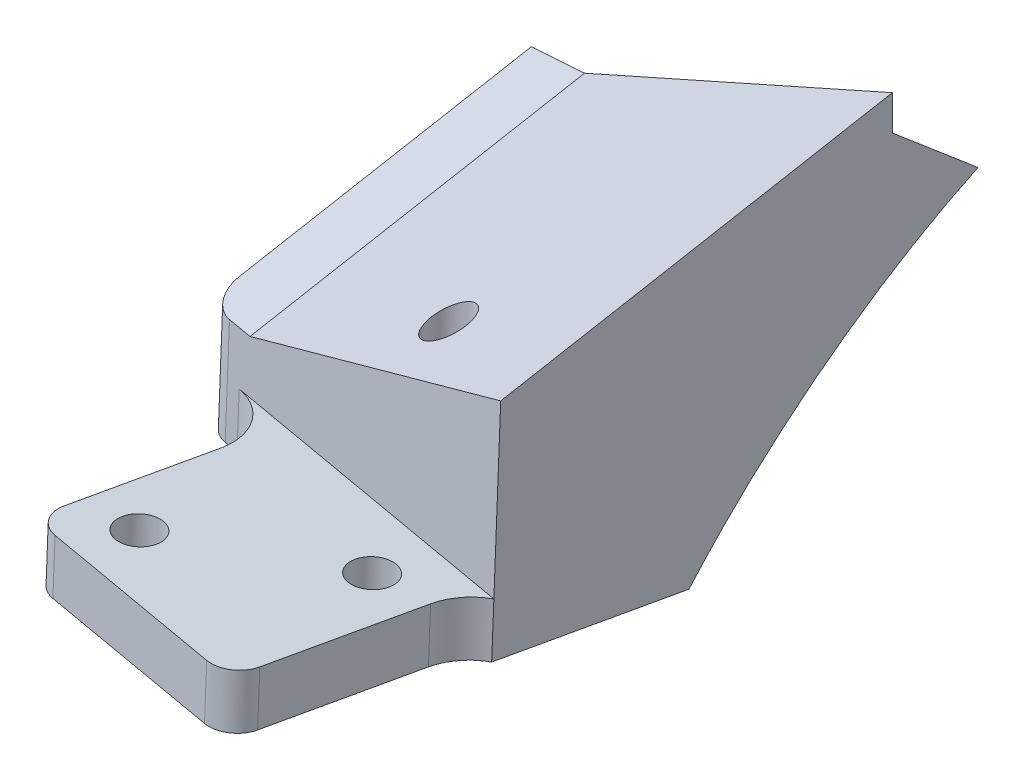
ISO-10303-21;
HEADER;
FILE_DESCRIPTION(('STEP AP214'),'2;1');
FILE_NAME('part.step','',(''),(''),'','','');
FILE_SCHEMA(('AUTOMOTIVE_DESIGN { 1 0 10303 214 1 1 1 1 }'));
ENDSEC;
DATA;
#1=APPLICATION_CONTEXT('core data for automotive mechanical design processes');
#2=APPLICATION_PROTOCOL_DEFINITION('international standard','automotive_design',2000,#1);
#3=PRODUCT_CONTEXT('',#1,'mechanical');
#4=PRODUCT('Part','Part','',(#3));
#5=PRODUCT_RELATED_PRODUCT_CATEGORY('part','',(#4));
#6=PRODUCT_DEFINITION_FORMATION('','',#4);
#7=PRODUCT_DEFINITION_CONTEXT('part definition',#1,'design');
#8=PRODUCT_DEFINITION('design','',#6,#7);
#9=PRODUCT_DEFINITION_SHAPE('','',#8);
#10=(LENGTH_UNIT() NAMED_UNIT(*) SI_UNIT(.MILLI.,.METRE.));
#11=(NAMED_UNIT(*) PLANE_ANGLE_UNIT() SI_UNIT($,.RADIAN.));
#12=(NAMED_UNIT(*) SI_UNIT($,.STERADIAN.) SOLID_ANGLE_UNIT());
#13=UNCERTAINTY_MEASURE_WITH_UNIT(LENGTH_MEASURE(1.E-05),#10,'distance_accuracy_value','');
#14=(GEOMETRIC_REPRESENTATION_CONTEXT(3) GLOBAL_UNCERTAINTY_ASSIGNED_CONTEXT((#13)) GLOBAL_UNIT_ASSIGNED_CONTEXT((#10,
#11,#12)) REPRESENTATION_CONTEXT('',''));
#15=CARTESIAN_POINT('',(0.,0.,0.));
#16=DIRECTION('',(0.,0.,1.));
#17=DIRECTION('',(1.,0.,0.));
#18=AXIS2_PLACEMENT_3D('',#15,#16,#17);
#19=CARTESIAN_POINT('',(824.732085834627,5821.44498100306,18.9934864671472));
#20=DIRECTION('',(-0.00606023370630814,-0.999390827085141,0.0343692930608406));
#21=DIRECTION('',(0.,0.0343699242089877,0.999409179620574));
#22=AXIS2_PLACEMENT_3D('',#19,#20,#21);
#23=PLANE('',#22);
#24=CARTESIAN_POINT('',(838.819100795339,5821.1208398731,12.0520265814064));
#25=DIRECTION('',(-0.00606023370630814,-0.999390827085141,0.0343692930608406));
#26=DIRECTION('',(-0.462317085890736,-0.0276760183058803,-0.88628265813127));
#27=AXIS2_PLACEMENT_3D('',#24,#25,#26);
#28=ELLIPSE('',#27,3.48633872282764,2.52729999999997);
#29=CARTESIAN_POINT('',(837.207306836573,5821.02435189878,8.9621450309927));
#30=VERTEX_POINT('',#29);
#31=EDGE_CURVE('E329',#30,#30,#28,.T.);
#32=ORIENTED_EDGE('',*,*,#31,.F.);
#33=EDGE_LOOP('',(#32));
#34=FACE_BOUND('',#33,.T.);
#35=DIRECTION('',(-0.394397487112533,0.0339725620847751,0.918311759254293));
#36=VECTOR('',#35,1.);
#37=CARTESIAN_POINT('',(821.226521874585,5820.95180967383,4.0349175322677));
#38=LINE('',#37,#36);
#39=CARTESIAN_POINT('',(823.135376170953,5820.78738501795,-0.409642598910876));
#40=VERTEX_POINT('',#39);
#41=CARTESIAN_POINT('',(821.371793384874,5820.9392962944,3.69666858154716));
#42=VERTEX_POINT('',#41);
#43=EDGE_CURVE('E219',#40,#42,#38,.T.);
#44=ORIENTED_EDGE('',*,*,#43,.F.);
#45=DIRECTION('',(0.984807753010193,-3.09363076460256E-11,0.17364817767836));
#46=VECTOR('',#45,1.);
#47=CARTESIAN_POINT('',(859.669425506688,5820.78738501681,6.03229601399774));
#48=LINE('',#47,#46);
#49=CARTESIAN_POINT('',(838.636761234494,5820.78738501747,2.32366982637515));
#50=VERTEX_POINT('',#49);
#51=EDGE_CURVE('E292',#40,#50,#48,.T.);
#52=ORIENTED_EDGE('',*,*,#51,.T.);
#53=CARTESIAN_POINT('',(838.836445724791,5820.85675702432,4.37607986175295));
#54=DIRECTION('',(-0.00606023370630814,-0.999390827085141,0.0343692930608406));
#55=DIRECTION('',(-0.462317085890736,-0.0276760183058803,-0.88628265813127));
#56=AXIS2_PLACEMENT_3D('',#53,#54,#55);
#57=ELLIPSE('',#56,2.18991125805627,1.58749999999905);
#58=CARTESIAN_POINT('',(840.32308241607,5820.82814107145,3.80611890873291));
#59=VERTEX_POINT('',#58);
#60=EDGE_CURVE('E67',#50,#59,#57,.T.);
#61=ORIENTED_EDGE('',*,*,#60,.T.);
#62=CARTESIAN_POINT('',(862.622632785247,5820.3989017783,-4.74329538659908));
#63=DIRECTION('',(-0.00606023370630814,-0.999390827085141,0.0343692930608406));
#64=DIRECTION('',(-0.462317085890736,-0.0276760183058803,-0.88628265813127));
#65=AXIS2_PLACEMENT_3D('',#62,#63,#64);
#66=ELLIPSE('',#65,32.8486688708639,23.8125);
#67=CARTESIAN_POINT('',(860.135504626068,5821.41636155642,24.4038677292095));
#68=VERTEX_POINT('',#67);
#69=EDGE_CURVE('E55',#59,#68,#66,.F.);
#70=ORIENTED_EDGE('',*,*,#69,.T.);
#71=DIRECTION('',(0.173542395900398,-0.0348994948111996,-0.984207834802727));
#72=VECTOR('',#71,1.);
#73=CARTESIAN_POINT('',(856.654669511219,5822.11635988478,44.1446646331368));
#74=LINE('',#73,#72);
#75=CARTESIAN_POINT('',(856.654669511219,5822.11635988478,44.1446646331368));
#76=VERTEX_POINT('',#75);
#77=EDGE_CURVE('E263',#76,#68,#74,.T.);
#78=ORIENTED_EDGE('',*,*,#77,.F.);
#79=CARTESIAN_POINT('',(859.845174788359,5822.28573508757,49.6323315327014));
#80=DIRECTION('',(0.00606023370630814,0.999390827085141,-0.0343692930608406));
#81=DIRECTION('',(0.,0.0343699242089877,0.999409179620574));
#82=AXIS2_PLACEMENT_3D('',#79,#80,#81);
#83=CIRCLE('',#82,6.35);
#84=CARTESIAN_POINT('',(853.591645556733,5822.28573508801,48.5296656045025));
#85=VERTEX_POINT('',#84);
#86=EDGE_CURVE('E235',#85,#76,#83,.F.);
#87=ORIENTED_EDGE('',*,*,#86,.F.);
#88=DIRECTION('',(0.173542395900156,-0.0348994948112074,-0.98420783480277));
#89=VECTOR('',#88,1.);
#90=CARTESIAN_POINT('',(850.025909509087,5823.00280705217,68.7519596250967));
#91=LINE('',#90,#89);
#92=CARTESIAN_POINT('',(850.576906616351,5822.89200115609,65.6270997480084));
#93=VERTEX_POINT('',#92);
#94=EDGE_CURVE('E252',#93,#85,#91,.T.);
#95=ORIENTED_EDGE('',*,*,#94,.F.);
#96=CARTESIAN_POINT('',(847.450142000536,5822.89200115595,65.0757667839216));
#97=DIRECTION('',(0.00606023370630814,0.999390827085141,-0.0343692930608406));
#98=DIRECTION('',(0.,0.0343699242089877,0.999409179620574));
#99=AXIS2_PLACEMENT_3D('',#96,#97,#98);
#100=CIRCLE('',#99,3.175);
#101=CARTESIAN_POINT('',(846.899144891964,5823.00280705219,68.2006266591323));
#102=VERTEX_POINT('',#101);
#103=EDGE_CURVE('E226',#102,#93,#100,.T.);
#104=ORIENTED_EDGE('',*,*,#103,.F.);
#105=DIRECTION('',(0.984807752923825,-6.26330527505035E-12,0.173648178168175));
#106=VECTOR('',#105,1.);
#107=CARTESIAN_POINT('',(822.095449303528,5823.00280705235,63.8270658925945));
#108=LINE('',#107,#106);
#109=CARTESIAN_POINT('',(825.222213917472,5823.00280705233,64.3783988579982));
#110=VERTEX_POINT('',#109);
#111=EDGE_CURVE('E258',#110,#102,#108,.T.);
#112=ORIENTED_EDGE('',*,*,#111,.F.);
#113=CARTESIAN_POINT('',(825.773211026045,5822.89200115624,61.2535389827819));
#114=DIRECTION('',(0.00606023370630814,0.999390827085141,-0.0343692930608406));
#115=DIRECTION('',(0.,0.0343699242089877,0.999409179620574));
#116=AXIS2_PLACEMENT_3D('',#113,#114,#115);
#117=CIRCLE('',#116,3.175);
#118=CARTESIAN_POINT('',(822.646446410232,5822.89200115638,60.7022060186847));
#119=VERTEX_POINT('',#118);
#120=EDGE_CURVE('E349',#119,#110,#117,.T.);
#121=ORIENTED_EDGE('',*,*,#120,.F.);
#122=DIRECTION('',(-0.173542395900381,0.034899494811193,0.984207834802731));
#123=VECTOR('',#122,1.);
#124=CARTESIAN_POINT('',(826.503426152613,5822.11635988551,38.8281869270818));
#125=LINE('',#124,#123);
#126=CARTESIAN_POINT('',(825.401431940732,5822.33797167714,45.0779066662515));
#127=VERTEX_POINT('',#126);
#128=EDGE_CURVE('E276',#127,#119,#125,.T.);
#129=ORIENTED_EDGE('',*,*,#128,.F.);
#130=CARTESIAN_POINT('',(819.147902709105,5822.3379716773,43.9752407380609));
#131=DIRECTION('',(0.00606023370630814,0.999390827085141,-0.0343692930608406));
#132=DIRECTION('',(0.,0.0343699242089877,0.999409179620574));
#133=AXIS2_PLACEMENT_3D('',#130,#131,#132);
#134=CIRCLE('',#133,6.35);
#135=CARTESIAN_POINT('',(820.249896991847,5822.11635987143,37.7255205970252));
#136=VERTEX_POINT('',#135);
#137=EDGE_CURVE('E228',#136,#127,#134,.F.);
#138=ORIENTED_EDGE('',*,*,#137,.F.);
#139=DIRECTION('',(0.984807741852991,2.21277309512399E-09,0.173648240953985));
#140=VECTOR('',#139,1.);
#141=CARTESIAN_POINT('',(815.435727924869,5822.11635986061,36.8766523818313));
#142=LINE('',#141,#140);
#143=CARTESIAN_POINT('',(818.562405221485,5822.11635986763,37.4279701563714));
#144=VERTEX_POINT('',#143);
#145=EDGE_CURVE('E190',#144,#136,#142,.T.);
#146=ORIENTED_EDGE('',*,*,#145,.F.);
#147=CARTESIAN_POINT('',(819.113402240573,5822.00555398928,34.3031107793532));
#148=DIRECTION('',(0.00606023370630814,0.999390827085141,-0.0343692930608406));
#149=DIRECTION('',(0.,0.0343699242089877,0.999409179620574));
#150=AXIS2_PLACEMENT_3D('',#147,#148,#149);
#151=CIRCLE('',#150,3.175);
#152=CARTESIAN_POINT('',(815.986637618731,5822.00555299508,33.7517778494515));
#153=VERTEX_POINT('',#152);
#154=EDGE_CURVE('E359',#153,#144,#151,.T.);
#155=ORIENTED_EDGE('',*,*,#154,.F.);
#156=DIRECTION('',(-0.173542394001316,0.0348998079770558,0.984207824032839));
#157=VECTOR('',#156,1.);
#158=CARTESIAN_POINT('',(815.435640641101,5822.11635986061,36.8766369913481));
#159=LINE('',#158,#157);
#160=CARTESIAN_POINT('',(816.438342989376,5821.91471573083,31.1900293930887));
#161=VERTEX_POINT('',#160);
#162=EDGE_CURVE('E211',#161,#153,#159,.T.);
#163=ORIENTED_EDGE('',*,*,#162,.F.);
#164=DIRECTION('',(-0.173542395900339,0.0348994948112006,0.984207834802738));
#165=VECTOR('',#164,1.);
#166=CARTESIAN_POINT('',(832.201860924864,5818.74466146517,-58.2093232876828));
#167=LINE('',#166,#165);
#168=CARTESIAN_POINT('',(821.162599646967,5820.96466447762,4.39743849967588));
#169=VERTEX_POINT('',#168);
#170=EDGE_CURVE('E216',#169,#161,#167,.T.);
#171=ORIENTED_EDGE('',*,*,#170,.F.);
#172=CARTESIAN_POINT('',(824.289364262781,5820.96466447753,4.94877146377141));
#173=DIRECTION('',(0.00606023370630814,0.999390827085141,-0.0343692930608406));
#174=DIRECTION('',(0.,0.0343699242089877,0.999409179620574));
#175=AXIS2_PLACEMENT_3D('',#172,#173,#174);
#176=CIRCLE('',#175,3.175);
#177=EDGE_CURVE('E362',#42,#169,#176,.T.);
#178=ORIENTED_EDGE('',*,*,#177,.F.);
#179=EDGE_LOOP('',(#44,#52,#61,#70,#78,#87,#95,#104,#112,#121,#129,#138,#146,#155,#163,#171,#178));
#180=FACE_BOUND('',#179,.T.);
#181=CARTESIAN_POINT('',(829.450972748561,5822.78119526018,58.6800120729679));
#182=DIRECTION('',(0.00606023370630815,0.999390827085141,-0.0343692930608406));
#183=DIRECTION('',(0.,0.0343699242089877,0.999409179620574));
#184=AXIS2_PLACEMENT_3D('',#181,#182,#183);
#185=CIRCLE('',#184,2.45744999999995);
#186=CARTESIAN_POINT('',(829.450972748561,5822.86565763043,61.1360101614264));
#187=VERTEX_POINT('',#186);
#188=EDGE_CURVE('E305',#187,#187,#185,.T.);
#189=ORIENTED_EDGE('',*,*,#188,.T.);
#190=EDGE_LOOP('',(#189));
#191=FACE_BOUND('',#190,.T.);
#192=CARTESIAN_POINT('',(847.078362669451,5822.33797172624,48.9001358612131));
#193=DIRECTION('',(0.00606023370630815,0.999390827085141,-0.0343692930608406));
#194=DIRECTION('',(0.,0.0343699242089877,0.999409179620574));
#195=AXIS2_PLACEMENT_3D('',#192,#193,#194);
#196=CIRCLE('',#195,2.45744999999995);
#197=CARTESIAN_POINT('',(847.078362669451,5822.42243409648,51.3561339496716));
#198=VERTEX_POINT('',#197);
#199=EDGE_CURVE('E300',#198,#198,#196,.T.);
#200=ORIENTED_EDGE('',*,*,#199,.T.);
#201=EDGE_LOOP('',(#200));
#202=FACE_BOUND('',#201,.T.);
#203=CARTESIAN_POINT('',(841.570650488862,5821.89474809187,35.040914006106));
#204=DIRECTION('',(0.00606023370630815,0.999390827085141,-0.0343692930608406));
#205=DIRECTION('',(0.,0.0343699242089877,0.999409179620574));
#206=AXIS2_PLACEMENT_3D('',#203,#204,#205);
#207=CIRCLE('',#206,2.45744999999995);
#208=CARTESIAN_POINT('',(841.570650488862,5821.97921046212,37.4969120945646));
#209=VERTEX_POINT('',#208);
#210=EDGE_CURVE('E294',#209,#209,#207,.T.);
#211=ORIENTED_EDGE('',*,*,#210,.T.);
#212=EDGE_LOOP('',(#211));
#213=FACE_BOUND('',#212,.T.);
#214=ADVANCED_FACE('F37',(#34,#180,#191,#202,#213),#23,.T.);
#215=CARTESIAN_POINT('',(821.73528087452,5904.85106214043,1.14960188051162));
#216=DIRECTION('',(-0.918919961545479,-0.00798997894069778,-0.394363112511532));
#217=DIRECTION('',(0.394375701138189,0.,-0.918949294766453));
#218=AXIS2_PLACEMENT_3D('',#215,#216,#217);
#219=PLANE('',#218);
#220=DIRECTION('',(0.246216324644758,0.769476460634136,-0.589307642923788));
#221=VECTOR('',#220,1.);
#222=CARTESIAN_POINT('',(838.7507650414,5869.58867460261,-37.7843699727308));
#223=LINE('',#222,#221);
#224=CARTESIAN_POINT('',(826.585949048063,5831.57113223078,-8.66843279846676));
#225=VERTEX_POINT('',#224);
#226=EDGE_CURVE('E326',#40,#225,#223,.T.);
#227=ORIENTED_EDGE('',*,*,#226,.F.);
#228=ORIENTED_EDGE('',*,*,#43,.T.);
#229=DIRECTION('',(-0.00606023365258398,-0.999390827089769,0.0343692929357497));
#230=VECTOR('',#229,1.);
#231=CARTESIAN_POINT('',(821.371793384874,5820.93929629445,3.69666858154542));
#232=LINE('',#231,#230);
#233=CARTESIAN_POINT('',(821.486485041997,5839.85305385615,3.04621987165795));
#234=VERTEX_POINT('',#233);
#235=EDGE_CURVE('E368',#234,#42,#232,.T.);
#236=ORIENTED_EDGE('',*,*,#235,.F.);
#237=DIRECTION('',(-0.334920499749828,0.543936642431572,0.769390140219897));
#238=VECTOR('',#237,1.);
#239=CARTESIAN_POINT('',(810.162075274232,5858.24476601232,29.0610180868656));
#240=LINE('',#239,#238);
#241=EDGE_CURVE('E257',#225,#234,#240,.T.);
#242=ORIENTED_EDGE('',*,*,#241,.F.);
#243=EDGE_LOOP('',(#227,#228,#236,#242));
#244=FACE_BOUND('',#243,.T.);
#245=ADVANCED_FACE('F417',(#244),#219,.T.);
#246=CARTESIAN_POINT('',(806.847681514202,5809.38781094641,85.5813734553546));
#247=DIRECTION('',(0.984807753012215,-1.37745668311619E-13,0.173648177666893));
#248=DIRECTION('',(-0.173648177666893,0.,0.984807753012215));
#249=AXIS2_PLACEMENT_3D('',#246,#247,#248);
#250=PLANE('',#249);
#251=ORIENTED_EDGE('',*,*,#170,.T.);
#252=ORIENTED_EDGE('',*,*,#162,.T.);
#253=DIRECTION('',(-0.00606023367558917,-0.999390827085143,0.0343692930662186));
#254=VECTOR('',#253,1.);
#255=CARTESIAN_POINT('',(815.899086717089,5807.56756715369,34.2483036862117));
#256=LINE('',#255,#254);
#257=CARTESIAN_POINT('',(816.069722640328,5835.70707225937,33.280579276997));
#258=VERTEX_POINT('',#257);
#259=EDGE_CURVE('E354',#258,#153,#256,.T.);
#260=ORIENTED_EDGE('',*,*,#259,.F.);
#261=DIRECTION('',(-0.162114539766769,-0.358367949545289,0.91939724207489));
#262=VECTOR('',#261,1.);
#263=CARTESIAN_POINT('',(806.502984955835,5814.5589866357,87.5362447801086));
#264=LINE('',#263,#262);
#265=CARTESIAN_POINT('',(821.226521874589,5847.10661464747,4.03491753231538));
#266=VERTEX_POINT('',#265);
#267=EDGE_CURVE('E184',#266,#258,#264,.T.);
#268=ORIENTED_EDGE('',*,*,#267,.F.);
#269=DIRECTION('',(-1.39870617275604E-13,-1.,0.));
#270=VECTOR('',#269,1.);
#271=CARTESIAN_POINT('',(821.226521874589,5847.52345795996,4.03491753231544));
#272=LINE('',#271,#270);
#273=CARTESIAN_POINT('',(821.226521874588,5840.62791193934,4.03491753231544));
#274=VERTEX_POINT('',#273);
#275=EDGE_CURVE('E182',#266,#274,#272,.T.);
#276=ORIENTED_EDGE('',*,*,#275,.T.);
#277=DIRECTION('',(-0.134949979968397,0.629320391056686,0.765339368062815));
#278=VECTOR('',#277,1.);
#279=CARTESIAN_POINT('',(816.079524872091,5864.63021388503,33.2249880658916));
#280=LINE('',#279,#278);
#281=CARTESIAN_POINT('',(821.280314980698,5840.37705530198,3.72984167105106));
#282=VERTEX_POINT('',#281);
#283=EDGE_CURVE('E391',#282,#274,#280,.T.);
#284=ORIENTED_EDGE('',*,*,#283,.F.);
#285=DIRECTION('',(-0.00606023365258398,-0.999390827089769,0.0343692929357498));
#286=VECTOR('',#285,1.);
#287=CARTESIAN_POINT('',(821.278632886759,5840.09966192704,3.73938129639041));
#288=LINE('',#287,#286);
#289=EDGE_CURVE('E355',#169,#282,#288,.F.);
#290=ORIENTED_EDGE('',*,*,#289,.F.);
#291=EDGE_LOOP('',(#251,#252,#260,#268,#276,#284,#290));
#292=FACE_BOUND('',#291,.T.);
#293=ADVANCED_FACE('F398',(#292),#250,.F.);
#294=CARTESIAN_POINT('',(-0.711464825880899,-1.57275338283267,4.03491753231544));
#295=DIRECTION('',(0.,0.,1.));
#296=DIRECTION('',(-1.,0.,0.));
#297=AXIS2_PLACEMENT_3D('',#294,#295,#296);
#298=PLANE('',#297);
#299=DIRECTION('',(-0.913545457642889,-0.406736643075152,0.));
#300=VECTOR('',#299,1.);
#301=CARTESIAN_POINT('',(861.14432243096,5862.51175722371,4.03491753231544));
#302=LINE('',#301,#300);
#303=CARTESIAN_POINT('',(863.727100114488,5863.66168393618,4.03491753231544));
#304=VERTEX_POINT('',#303);
#305=CARTESIAN_POINT('',(827.480051106216,5847.52345795996,4.03491753231577));
#306=VERTEX_POINT('',#305);
#307=EDGE_CURVE('E180',#304,#306,#302,.T.);
#308=ORIENTED_EDGE('',*,*,#307,.F.);
#309=DIRECTION('',(-5.29916329728926E-11,-1.,0.));
#310=VECTOR('',#309,1.);
#311=CARTESIAN_POINT('',(863.727100112485,5818.94933417387,4.03491753231544));
#312=LINE('',#311,#310);
#313=CARTESIAN_POINT('',(863.727100114564,5859.55038851364,4.0349175323028));
#314=VERTEX_POINT('',#313);
#315=EDGE_CURVE('E195',#304,#314,#312,.T.);
#316=ORIENTED_EDGE('',*,*,#315,.T.);
#317=DIRECTION('',(0.913545457642691,0.406736643075598,0.));
#318=VECTOR('',#317,1.);
#319=CARTESIAN_POINT('',(-2035.53500010733,4568.71573526781,4.03491753231544));
#320=LINE('',#319,#318);
#321=EDGE_CURVE('E206',#274,#314,#320,.T.);
#322=ORIENTED_EDGE('',*,*,#321,.F.);
#323=ORIENTED_EDGE('',*,*,#275,.F.);
#324=DIRECTION('',(-0.997785778769943,-0.0665096961687352,0.));
#325=VECTOR('',#324,1.);
#326=CARTESIAN_POINT('',(-385.208158754962,5766.6889480868,4.03491753231544));
#327=LINE('',#326,#325);
#328=EDGE_CURVE('E166',#306,#266,#327,.T.);
#329=ORIENTED_EDGE('',*,*,#328,.F.);
#330=EDGE_LOOP('',(#308,#316,#322,#323,#329));
#331=FACE_BOUND('',#330,.T.);
#332=ADVANCED_FACE('F178',(#331),#298,.F.);
#333=CARTESIAN_POINT('',(813.101210745852,5815.73781094641,85.5813734553546));
#334=DIRECTION('',(0.391225810938873,-0.878707558270885,-0.27352402434309));
#335=DIRECTION('',(0.913545457642889,0.406736643075152,0.));
#336=AXIS2_PLACEMENT_3D('',#333,#334,#335);
#337=PLANE('',#336);
#338=CARTESIAN_POINT('',(841.70741039537,5844.44777206768,34.2653100387438));
#339=DIRECTION('',(-0.391225810938873,0.878707558270885,0.27352402434309));
#340=DIRECTION('',(-0.690935587901324,-0.476776362710872,0.543408054165231));
#341=AXIS2_PLACEMENT_3D('',#338,#339,#340);
#342=ELLIPSE('',#341,2.83639024401117,2.45744999999995);
#343=CARTESIAN_POINT('',(839.747647434607,5843.09544824391,35.8066273420952));
#344=VERTEX_POINT('',#343);
#345=EDGE_CURVE('E309',#344,#344,#342,.T.);
#346=ORIENTED_EDGE('',*,*,#345,.F.);
#347=EDGE_LOOP('',(#346));
#348=FACE_BOUND('',#347,.T.);
#349=DIRECTION('',(0.162114539766769,0.358367949545303,-0.919397242074885));
#350=VECTOR('',#349,1.);
#351=CARTESIAN_POINT('',(813.101210745852,5815.73781094641,85.5813734553546));
#352=LINE('',#351,#350);
#353=CARTESIAN_POINT('',(821.57552036301,5834.47099160795,37.5211753897621));
#354=VERTEX_POINT('',#353);
#355=EDGE_CURVE('E162',#354,#306,#352,.T.);
#356=ORIENTED_EDGE('',*,*,#355,.F.);
#357=DIRECTION('',(-0.91974172493257,-0.363020444838897,-0.149302766374339));
#358=VECTOR('',#357,1.);
#359=CARTESIAN_POINT('',(814.751788010703,5831.77767642299,36.4134708140323));
#360=LINE('',#359,#358);
#361=CARTESIAN_POINT('',(856.813927471259,5848.37952905624,43.2414678597368));
#362=VERTEX_POINT('',#361);
#363=EDGE_CURVE('E201',#362,#354,#360,.T.);
#364=ORIENTED_EDGE('',*,*,#363,.F.);
#365=DIRECTION('',(0.162114539766769,0.358367949545303,-0.919397242074884));
#366=VECTOR('',#365,1.);
#367=CARTESIAN_POINT('',(866.563044983366,5869.93078076825,-12.0485250439907));
#368=LINE('',#367,#366);
#369=EDGE_CURVE('E188',#362,#304,#368,.T.);
#370=ORIENTED_EDGE('',*,*,#369,.T.);
#371=ORIENTED_EDGE('',*,*,#307,.T.);
#372=EDGE_LOOP('',(#356,#364,#370,#371));
#373=FACE_BOUND('',#372,.T.);
#374=ADVANCED_FACE('F186',(#348,#373),#337,.F.);
#375=CARTESIAN_POINT('',(867.351469080837,6164.49539327973,33.8902176263409));
#376=DIRECTION('',(0.173542395900381,-0.0348994948111627,-0.984207834802732));
#377=DIRECTION('',(-0.00606023367545488,-0.999390827085143,0.0343692930662423));
#378=AXIS2_PLACEMENT_3D('',#375,#376,#377);
#379=PLANE('',#378);
#380=ORIENTED_EDGE('',*,*,#145,.T.);
#381=DIRECTION('',(0.00606023367545487,0.999390827085143,-0.0343692930662423));
#382=VECTOR('',#381,1.);
#383=CARTESIAN_POINT('',(820.249896923071,5822.11635988509,37.7255209870692));
#384=LINE('',#383,#382);
#385=CARTESIAN_POINT('',(820.288379406912,5828.46249163724,37.507275976093));
#386=VERTEX_POINT('',#385);
#387=EDGE_CURVE('E212',#386,#136,#384,.F.);
#388=ORIENTED_EDGE('',*,*,#387,.F.);
#389=DIRECTION('',(0.984807753012018,-3.13034511506549E-11,0.173648177668007));
#390=VECTOR('',#389,1.);
#391=CARTESIAN_POINT('',(865.31378986488,5828.46249163581,45.4464706573567));
#392=LINE('',#391,#390);
#393=CARTESIAN_POINT('',(856.693151997142,5828.46249163609,43.9264196103476));
#394=VERTEX_POINT('',#393);
#395=EDGE_CURVE('E193',#386,#394,#392,.T.);
#396=ORIENTED_EDGE('',*,*,#395,.T.);
#397=DIRECTION('',(-0.00606023367545335,-0.999390827085143,0.0343692930662426));
#398=VECTOR('',#397,1.);
#399=CARTESIAN_POINT('',(857.17200594306,5907.43011346267,41.2107039326103));
#400=LINE('',#399,#398);
#401=EDGE_CURVE('E199',#362,#394,#400,.T.);
#402=ORIENTED_EDGE('',*,*,#401,.F.);
#403=ORIENTED_EDGE('',*,*,#363,.T.);
#404=DIRECTION('',(0.984807753012208,0.,0.173648177666931));
#405=VECTOR('',#404,1.);
#406=CARTESIAN_POINT('',(865.350224984392,5834.47099160795,45.2398368870553));
#407=LINE('',#406,#405);
#408=CARTESIAN_POINT('',(818.637322726573,5834.47099160795,37.0030918718045));
#409=VERTEX_POINT('',#408);
#410=EDGE_CURVE('E170',#409,#354,#407,.T.);
#411=ORIENTED_EDGE('',*,*,#410,.F.);
#412=DIRECTION('',(-0.00606023367558917,-0.999390827085143,0.0343692930662186));
#413=VECTOR('',#412,1.);
#414=CARTESIAN_POINT('',(820.63856682305,6164.49539327974,25.6534726110957));
#415=LINE('',#414,#413);
#416=EDGE_CURVE('E356',#144,#409,#415,.F.);
#417=ORIENTED_EDGE('',*,*,#416,.F.);
#418=EDGE_LOOP('',(#380,#388,#396,#402,#403,#411,#417));
#419=FACE_BOUND('',#418,.T.);
#420=ADVANCED_FACE('F282',(#419),#379,.F.);
#421=CARTESIAN_POINT('',(857.17200594306,5907.43011346267,41.2107039326103));
#422=DIRECTION('',(0.984807753012206,0.,0.173648177666944));
#423=DIRECTION('',(-0.173648177666944,0.,0.984807753012206));
#424=AXIS2_PLACEMENT_3D('',#421,#422,#423);
#425=PLANE('',#424);
#426=CARTESIAN_POINT('',(864.577537469682,5816.00811396758,-0.788152378920916));
#427=DIRECTION('',(0.984807753012206,0.,0.173648177666944));
#428=DIRECTION('',(0.109280339074445,0.777145961456999,-0.619759600234519));
#429=AXIS2_PLACEMENT_3D('',#426,#427,#428);
#430=ELLIPSE('',#429,56.7455269365032,23.8125);
#431=CARTESIAN_POINT('',(865.238098391799,5852.50405899442,-4.53437953433672));
#432=VERTEX_POINT('',#431);
#433=EDGE_CURVE('E202',#68,#432,#430,.F.);
#434=ORIENTED_EDGE('',*,*,#433,.T.);
#435=DIRECTION('',(0.134949979930567,-0.629320391069814,-0.765339368058691));
#436=VECTOR('',#435,1.);
#437=CARTESIAN_POINT('',(861.597482201222,5869.48156433357,16.1125808881413));
#438=LINE('',#437,#436);
#439=EDGE_CURVE('E215',#314,#432,#438,.T.);
#440=ORIENTED_EDGE('',*,*,#439,.F.);
#441=ORIENTED_EDGE('',*,*,#315,.F.);
#442=ORIENTED_EDGE('',*,*,#369,.F.);
#443=ORIENTED_EDGE('',*,*,#401,.T.);
#444=EDGE_CURVE('E267',#394,#76,#400,.T.);
#445=ORIENTED_EDGE('',*,*,#444,.T.);
#446=ORIENTED_EDGE('',*,*,#77,.T.);
#447=EDGE_LOOP('',(#434,#440,#441,#442,#443,#445,#446));
#448=FACE_BOUND('',#447,.T.);
#449=ADVANCED_FACE('F288',(#448),#425,.T.);
#450=CARTESIAN_POINT('',(824.770568320552,5827.79111275463,18.775241444349));
#451=DIRECTION('',(-0.00606023370630814,-0.999390827085141,0.0343692930608406));
#452=DIRECTION('',(0.,0.0343699242089877,0.999409179620574));
#453=AXIS2_PLACEMENT_3D('',#450,#451,#452);
#454=PLANE('',#453);
#455=CARTESIAN_POINT('',(829.489455232596,5829.12732701217,58.4617670620317));
#456=DIRECTION('',(0.00606023370630814,0.999390827085141,-0.0343692930608406));
#457=DIRECTION('',(0.,0.0343699242089877,0.999409179620574));
#458=AXIS2_PLACEMENT_3D('',#455,#456,#457);
#459=CIRCLE('',#458,2.45744999999999);
#460=CARTESIAN_POINT('',(829.489455232596,5829.21178938241,60.9177651504902));
#461=VERTEX_POINT('',#460);
#462=EDGE_CURVE('E313',#461,#461,#459,.T.);
#463=ORIENTED_EDGE('',*,*,#462,.F.);
#464=EDGE_LOOP('',(#463));
#465=FACE_BOUND('',#464,.T.);
#466=CARTESIAN_POINT('',(847.116845153486,5828.68410347822,48.6818908502769));
#467=DIRECTION('',(0.00606023370630814,0.999390827085141,-0.0343692930608406));
#468=DIRECTION('',(0.,0.0343699242089877,0.999409179620574));
#469=AXIS2_PLACEMENT_3D('',#466,#467,#468);
#470=CIRCLE('',#469,2.45744999999999);
#471=CARTESIAN_POINT('',(847.116845153486,5828.76856584847,51.1378889387354));
#472=VERTEX_POINT('',#471);
#473=EDGE_CURVE('E311',#472,#472,#470,.T.);
#474=ORIENTED_EDGE('',*,*,#473,.F.);
#475=EDGE_LOOP('',(#474));
#476=FACE_BOUND('',#475,.T.);
#477=DIRECTION('',(0.984807752923825,-6.26330527505035E-12,0.173648178168175));
#478=VECTOR('',#477,1.);
#479=CARTESIAN_POINT('',(822.133931789453,5829.34893880392,63.6088208697964));
#480=LINE('',#479,#478);
#481=CARTESIAN_POINT('',(825.260696403396,5829.3489388039,64.1601538352));
#482=VERTEX_POINT('',#481);
#483=CARTESIAN_POINT('',(846.937627377888,5829.34893880376,67.9823816363342));
#484=VERTEX_POINT('',#483);
#485=EDGE_CURVE('E266',#482,#484,#480,.T.);
#486=ORIENTED_EDGE('',*,*,#485,.T.);
#487=CARTESIAN_POINT('',(847.488624486461,5829.23813290752,64.8575217611234));
#488=DIRECTION('',(0.00606023370630814,0.999390827085141,-0.0343692930608406));
#489=DIRECTION('',(0.,0.0343699242089877,0.999409179620574));
#490=AXIS2_PLACEMENT_3D('',#487,#488,#489);
#491=CIRCLE('',#490,3.175);
#492=CARTESIAN_POINT('',(850.615389102275,5829.23813290766,65.4088547252103));
#493=VERTEX_POINT('',#492);
#494=EDGE_CURVE('E339',#493,#484,#491,.F.);
#495=ORIENTED_EDGE('',*,*,#494,.F.);
#496=DIRECTION('',(0.173542395900156,-0.0348994948112074,-0.98420783480277));
#497=VECTOR('',#496,1.);
#498=CARTESIAN_POINT('',(850.064391995012,5829.34893880374,68.5337146022986));
#499=LINE('',#498,#497);
#500=CARTESIAN_POINT('',(853.630128040572,5828.63186684,48.3114205935319));
#501=VERTEX_POINT('',#500);
#502=EDGE_CURVE('E270',#493,#501,#499,.T.);
#503=ORIENTED_EDGE('',*,*,#502,.T.);
#504=CARTESIAN_POINT('',(859.883657272198,5828.63186683956,49.4140865217308));
#505=DIRECTION('',(0.00606023370630814,0.999390827085141,-0.0343692930608406));
#506=DIRECTION('',(0.,0.0343699242089877,0.999409179620574));
#507=AXIS2_PLACEMENT_3D('',#504,#505,#506);
#508=CIRCLE('',#507,6.35);
#509=EDGE_CURVE('E238',#394,#501,#508,.T.);
#510=ORIENTED_EDGE('',*,*,#509,.F.);
#511=ORIENTED_EDGE('',*,*,#395,.F.);
#512=CARTESIAN_POINT('',(819.186385192944,5828.68410342929,43.7569957270903));
#513=DIRECTION('',(0.00606023370630814,0.999390827085141,-0.0343692930608406));
#514=DIRECTION('',(0.,0.0343699242089877,0.999409179620574));
#515=AXIS2_PLACEMENT_3D('',#512,#513,#514);
#516=CIRCLE('',#515,6.35);
#517=CARTESIAN_POINT('',(825.439914424571,5828.68410342913,44.8596616552808));
#518=VERTEX_POINT('',#517);
#519=EDGE_CURVE('E233',#518,#386,#516,.T.);
#520=ORIENTED_EDGE('',*,*,#519,.F.);
#521=DIRECTION('',(-0.173542395900381,0.034899494811193,0.984207834802731));
#522=VECTOR('',#521,1.);
#523=CARTESIAN_POINT('',(826.541908638538,5828.46249163708,38.6099419042837));
#524=LINE('',#523,#522);
#525=CARTESIAN_POINT('',(822.684928896156,5829.23813290795,60.4839609958866));
#526=VERTEX_POINT('',#525);
#527=EDGE_CURVE('E274',#518,#526,#524,.T.);
#528=ORIENTED_EDGE('',*,*,#527,.T.);
#529=CARTESIAN_POINT('',(825.811693511969,5829.23813290782,61.0352939599838));
#530=DIRECTION('',(0.00606023370630814,0.999390827085141,-0.0343692930608406));
#531=DIRECTION('',(0.,0.0343699242089877,0.999409179620574));
#532=AXIS2_PLACEMENT_3D('',#529,#530,#531);
#533=CIRCLE('',#532,3.175);
#534=EDGE_CURVE('E342',#482,#526,#533,.F.);
#535=ORIENTED_EDGE('',*,*,#534,.F.);
#536=EDGE_LOOP('',(#486,#495,#503,#510,#511,#520,#528,#535));
#537=FACE_BOUND('',#536,.T.);
#538=ADVANCED_FACE('F286',(#465,#476,#537),#454,.F.);
#539=CARTESIAN_POINT('',(826.503426152613,5822.11635988551,38.8281869270818));
#540=DIRECTION('',(0.984807753012208,0.,0.173648177666931));
#541=DIRECTION('',(-0.173648177666931,0.,0.984807753012208));
#542=AXIS2_PLACEMENT_3D('',#539,#540,#541);
#543=PLANE('',#542);
#544=ORIENTED_EDGE('',*,*,#527,.F.);
#545=DIRECTION('',(0.00606023367545488,0.999390827085143,-0.0343692930662423));
#546=VECTOR('',#545,1.);
#547=CARTESIAN_POINT('',(825.439914424571,5828.6841034292,44.8596616552787));
#548=LINE('',#547,#546);
#549=EDGE_CURVE('E231',#127,#518,#548,.T.);
#550=ORIENTED_EDGE('',*,*,#549,.F.);
#551=ORIENTED_EDGE('',*,*,#128,.T.);
#552=DIRECTION('',(0.00606023400388092,0.999390827019096,-0.034369294928839));
#553=VECTOR('',#552,1.);
#554=CARTESIAN_POINT('',(822.646446410487,5822.89200119842,60.7022060172391));
#555=LINE('',#554,#553);
#556=EDGE_CURVE('E340',#526,#119,#555,.F.);
#557=ORIENTED_EDGE('',*,*,#556,.F.);
#558=EDGE_LOOP('',(#544,#550,#551,#557));
#559=FACE_BOUND('',#558,.T.);
#560=ADVANCED_FACE('F408',(#559),#543,.F.);
#561=CARTESIAN_POINT('',(822.095449303528,5823.00280705235,63.8270658925945));
#562=DIRECTION('',(0.173542396389637,-0.0348994967024928,-0.984207834649397));
#563=DIRECTION('',(0.984807752923863,0.,0.17364817816796));
#564=AXIS2_PLACEMENT_3D('',#561,#562,#563);
#565=PLANE('',#564);
#566=ORIENTED_EDGE('',*,*,#111,.T.);
#567=DIRECTION('',(0.00606023400388092,0.999390827019096,-0.0343692949288389));
#568=VECTOR('',#567,1.);
#569=CARTESIAN_POINT('',(846.899144891967,5823.0028070528,68.2006266591115));
#570=LINE('',#569,#568);
#571=EDGE_CURVE('E80',#484,#102,#570,.F.);
#572=ORIENTED_EDGE('',*,*,#571,.F.);
#573=ORIENTED_EDGE('',*,*,#485,.F.);
#574=DIRECTION('',(0.00606023400388091,0.999390827019096,-0.0343692949288389));
#575=VECTOR('',#574,1.);
#576=CARTESIAN_POINT('',(825.222213917472,5823.00280705241,64.3783988579955));
#577=LINE('',#576,#575);
#578=EDGE_CURVE('E345',#110,#482,#577,.T.);
#579=ORIENTED_EDGE('',*,*,#578,.F.);
#580=EDGE_LOOP('',(#566,#572,#573,#579));
#581=FACE_BOUND('',#580,.T.);
#582=ADVANCED_FACE('F461',(#581),#565,.F.);
#583=CARTESIAN_POINT('',(850.025909509087,5823.00280705217,68.7519596250967));
#584=DIRECTION('',(-0.984807753012248,0.,-0.173648177666705));
#585=DIRECTION('',(0.173648177666705,0.,-0.984807753012248));
#586=AXIS2_PLACEMENT_3D('',#583,#584,#585);
#587=PLANE('',#586);
#588=ORIENTED_EDGE('',*,*,#94,.T.);
#589=DIRECTION('',(0.00606023367545488,0.999390827085143,-0.0343692930662423));
#590=VECTOR('',#589,1.);
#591=CARTESIAN_POINT('',(853.591645556733,5822.28573508801,48.5296656045025));
#592=LINE('',#591,#590);
#593=EDGE_CURVE('E232',#501,#85,#592,.F.);
#594=ORIENTED_EDGE('',*,*,#593,.F.);
#595=ORIENTED_EDGE('',*,*,#502,.F.);
#596=DIRECTION('',(0.00606023400388092,0.999390827019096,-0.034369294928839));
#597=VECTOR('',#596,1.);
#598=CARTESIAN_POINT('',(850.576906616314,5822.89200115009,65.6270997482149));
#599=LINE('',#598,#597);
#600=EDGE_CURVE('E254',#93,#493,#599,.T.);
#601=ORIENTED_EDGE('',*,*,#600,.F.);
#602=EDGE_LOOP('',(#588,#594,#595,#601));
#603=FACE_BOUND('',#602,.T.);
#604=ADVANCED_FACE('F253',(#603),#587,.F.);
#605=CARTESIAN_POINT('',(892.876516322818,5776.20883910597,-102.894057915364));
#606=DIRECTION('',(-0.314068466301227,0.705409324836672,-0.635420083809656));
#607=DIRECTION('',(0.939760342521629,0.326118889122343,-0.102454715758886));
#608=AXIS2_PLACEMENT_3D('',#605,#606,#607);
#609=PLANE('',#608);
#610=CARTESIAN_POINT('',(831.162118835801,5838.31870293135,-3.43950039600099));
#611=DIRECTION('',(-0.314068466301226,0.70540932483667,-0.635420083809655));
#612=DIRECTION('',(0.,0.669285715990173,0.743005134821773));
#613=AXIS2_PLACEMENT_3D('',#610,#611,#612);
#614=CIRCLE('',#613,2.99720000000029);
#615=CARTESIAN_POINT('',(831.162118835801,5840.32468607931,-1.21256540591296));
#616=VERTEX_POINT('',#615);
#617=EDGE_CURVE('E693',#616,#616,#614,.T.);
#618=ORIENTED_EDGE('',*,*,#617,.F.);
#619=EDGE_LOOP('',(#618));
#620=FACE_BOUND('',#619,.T.);
#621=DIRECTION('',(0.939760342519577,0.326118889123203,-0.102454715774997));
#622=VECTOR('',#621,1.);
#623=CARTESIAN_POINT('',(832.82851577842,5833.73744935997,-9.34901099597862));
#624=LINE('',#623,#622);
#625=CARTESIAN_POINT('',(832.865332718624,5833.75022570208,-9.35302485884737));
#626=VERTEX_POINT('',#625);
#627=EDGE_CURVE('E317',#225,#626,#624,.T.);
#628=ORIENTED_EDGE('',*,*,#627,.F.);
#629=ORIENTED_EDGE('',*,*,#241,.T.);
#630=CARTESIAN_POINT('',(824.418217904371,5842.21386951241,4.21800614884211));
#631=DIRECTION('',(0.314068466301227,-0.705409324836672,0.635420083809656));
#632=DIRECTION('',(0.339315211451099,0.708481243004554,0.618804909150387));
#633=AXIS2_PLACEMENT_3D('',#630,#631,#632);
#634=ELLIPSE('',#633,4.37982251647373,3.175);
#635=EDGE_CURVE('E365',#282,#234,#634,.T.);
#636=ORIENTED_EDGE('',*,*,#635,.F.);
#637=ORIENTED_EDGE('',*,*,#283,.T.);
#638=ORIENTED_EDGE('',*,*,#321,.T.);
#639=ORIENTED_EDGE('',*,*,#439,.T.);
#640=CARTESIAN_POINT('',(855.809516439311,5835.70141163617,-18.5275221525782));
#641=DIRECTION('',(-0.314068466301226,0.70540932483667,-0.635420083809655));
#642=DIRECTION('',(0.,0.669285715990173,0.743005134821774));
#643=AXIS2_PLACEMENT_3D('',#640,#641,#642);
#644=CIRCLE('',#643,23.8125);
#645=CARTESIAN_POINT('',(834.098500676275,5834.80878056121,-8.78739070832824));
#646=VERTEX_POINT('',#645);
#647=EDGE_CURVE('E11',#646,#432,#644,.T.);
#648=ORIENTED_EDGE('',*,*,#647,.F.);
#649=CARTESIAN_POINT('',(832.651099625407,5834.74927182287,-8.13804861204614));
#650=DIRECTION('',(0.314068466301226,-0.70540932483667,0.635420083809655));
#651=DIRECTION('',(0.,0.669285715990173,0.743005134821774));
#652=AXIS2_PLACEMENT_3D('',#649,#650,#651);
#653=CIRCLE('',#652,1.58749999999905);
#654=EDGE_CURVE('E321',#626,#646,#653,.T.);
#655=ORIENTED_EDGE('',*,*,#654,.F.);
#656=EDGE_LOOP('',(#628,#629,#636,#637,#638,#639,#648,#655));
#657=FACE_BOUND('',#656,.T.);
#658=ADVANCED_FACE('F388',(#620,#657),#609,.T.);
#659=CARTESIAN_POINT('',(-5.33646381398883,4020.3358239735,4690.60388510827));
#660=DIRECTION('',(0.0622299413727401,-0.933580426497206,-0.352923535143295));
#661=DIRECTION('',(0.16211453976677,0.35836794954529,-0.91939724207489));
#662=AXIS2_PLACEMENT_3D('',#659,#660,#661);
#663=PLANE('',#662);
#664=ORIENTED_EDGE('',*,*,#410,.T.);
#665=ORIENTED_EDGE('',*,*,#355,.T.);
#666=ORIENTED_EDGE('',*,*,#328,.T.);
#667=ORIENTED_EDGE('',*,*,#267,.T.);
#668=CARTESIAN_POINT('',(819.196487256142,5835.70707225937,33.8319122410894));
#669=DIRECTION('',(-0.0622299413727401,0.933580426497206,0.352923535143295));
#670=DIRECTION('',(-0.162114539767019,-0.358367949545289,0.919397242074846));
#671=AXIS2_PLACEMENT_3D('',#668,#669,#670);
#672=ELLIPSE('',#671,3.44919419549101,3.175);
#673=EDGE_CURVE('E351',#409,#258,#672,.F.);
#674=ORIENTED_EDGE('',*,*,#673,.F.);
#675=EDGE_LOOP('',(#664,#665,#666,#667,#674));
#676=FACE_BOUND('',#675,.T.);
#677=ADVANCED_FACE('F164',(#676),#663,.F.);
#678=CARTESIAN_POINT('',(861.921336477781,6164.66476848334,37.8578334888912));
#679=DIRECTION('',(0.00606023367545335,0.999390827085143,-0.0343692930662426));
#680=DIRECTION('',(0.,-0.0343699242143833,-0.999409179620388));
#681=AXIS2_PLACEMENT_3D('',#678,#679,#680);
#682=CYLINDRICAL_SURFACE('',#681,6.35);
#683=ORIENTED_EDGE('',*,*,#86,.T.);
#684=ORIENTED_EDGE('',*,*,#444,.F.);
#685=ORIENTED_EDGE('',*,*,#509,.T.);
#686=ORIENTED_EDGE('',*,*,#593,.T.);
#687=EDGE_LOOP('',(#683,#684,#685,#686));
#688=FACE_BOUND('',#687,.T.);
#689=ADVANCED_FACE('F243',(#688),#682,.F.);
#690=CARTESIAN_POINT('',(819.147902709104,5822.33797167714,43.9752407380665));
#691=DIRECTION('',(-0.00606023367545488,-0.999390827085143,0.0343692930662423));
#692=DIRECTION('',(0.,0.034369924214383,0.999409179620388));
#693=AXIS2_PLACEMENT_3D('',#690,#691,#692);
#694=CYLINDRICAL_SURFACE('',#693,6.35);
#695=ORIENTED_EDGE('',*,*,#137,.T.);
#696=ORIENTED_EDGE('',*,*,#549,.T.);
#697=ORIENTED_EDGE('',*,*,#519,.T.);
#698=ORIENTED_EDGE('',*,*,#387,.T.);
#699=EDGE_LOOP('',(#695,#696,#697,#698));
#700=FACE_BOUND('',#699,.T.);
#701=ADVANCED_FACE('F405',(#700),#694,.F.);
#702=CARTESIAN_POINT('',(824.798123258206,5904.86391694458,2.06345582251492));
#703=DIRECTION('',(0.00606023365258398,0.999390827089769,-0.0343692929357498));
#704=DIRECTION('',(0.,-0.0343699240838833,-0.999409179624876));
#705=AXIS2_PLACEMENT_3D('',#702,#703,#704);
#706=CYLINDRICAL_SURFACE('',#705,3.175);
#707=ORIENTED_EDGE('',*,*,#635,.T.);
#708=ORIENTED_EDGE('',*,*,#235,.T.);
#709=ORIENTED_EDGE('',*,*,#177,.T.);
#710=ORIENTED_EDGE('',*,*,#289,.T.);
#711=EDGE_LOOP('',(#707,#708,#709,#710));
#712=FACE_BOUND('',#711,.T.);
#713=ADVANCED_FACE('F420',(#712),#706,.T.);
#714=CARTESIAN_POINT('',(819.025851332903,5807.56756715369,34.799636650304));
#715=DIRECTION('',(-0.00606023367558917,-0.999390827085143,0.0343692930662186));
#716=DIRECTION('',(0.,0.0343699242143594,0.999409179620389));
#717=AXIS2_PLACEMENT_3D('',#714,#715,#716);
#718=CYLINDRICAL_SURFACE('',#717,3.175);
#719=ORIENTED_EDGE('',*,*,#673,.T.);
#720=ORIENTED_EDGE('',*,*,#259,.T.);
#721=ORIENTED_EDGE('',*,*,#154,.T.);
#722=ORIENTED_EDGE('',*,*,#416,.T.);
#723=EDGE_LOOP('',(#719,#720,#721,#722));
#724=FACE_BOUND('',#723,.T.);
#725=ADVANCED_FACE('F400',(#724),#718,.T.);
#726=CARTESIAN_POINT('',(825.773211026009,5822.89200115038,61.2535389829837));
#727=DIRECTION('',(0.00606023400388091,0.999390827019096,-0.0343692949288389));
#728=DIRECTION('',(0.,-0.0343699260770823,-0.99940917955633));
#729=AXIS2_PLACEMENT_3D('',#726,#727,#728);
#730=CYLINDRICAL_SURFACE('',#729,3.175);
#731=ORIENTED_EDGE('',*,*,#120,.T.);
#732=ORIENTED_EDGE('',*,*,#578,.T.);
#733=ORIENTED_EDGE('',*,*,#534,.T.);
#734=ORIENTED_EDGE('',*,*,#556,.T.);
#735=EDGE_LOOP('',(#731,#732,#733,#734));
#736=FACE_BOUND('',#735,.T.);
#737=ADVANCED_FACE('F376',(#736),#730,.T.);
#738=CARTESIAN_POINT('',(847.4501420005,5822.89200115009,65.0757667841231));
#739=DIRECTION('',(0.00606023400388092,0.999390827019096,-0.0343692949288389));
#740=DIRECTION('',(0.,-0.0343699260770823,-0.99940917955633));
#741=AXIS2_PLACEMENT_3D('',#738,#739,#740);
#742=CYLINDRICAL_SURFACE('',#741,3.175);
#743=ORIENTED_EDGE('',*,*,#103,.T.);
#744=ORIENTED_EDGE('',*,*,#600,.T.);
#745=ORIENTED_EDGE('',*,*,#494,.T.);
#746=ORIENTED_EDGE('',*,*,#571,.T.);
#747=EDGE_LOOP('',(#743,#744,#745,#746));
#748=FACE_BOUND('',#747,.T.);
#749=ADVANCED_FACE('F482',(#748),#742,.T.);
#750=CARTESIAN_POINT('',(841.570650488862,5821.89474809187,35.040914006106));
#751=DIRECTION('',(-0.00606023370630815,-0.999390827085141,0.0343692930608406));
#752=DIRECTION('',(0.,0.0343699242089877,0.999409179620574));
#753=AXIS2_PLACEMENT_3D('',#750,#751,#752);
#754=CYLINDRICAL_SURFACE('',#753,2.45744999999995);
#755=ORIENTED_EDGE('',*,*,#345,.T.);
#756=EDGE_LOOP('',(#755));
#757=FACE_BOUND('',#756,.T.);
#758=ORIENTED_EDGE('',*,*,#210,.F.);
#759=EDGE_LOOP('',(#758));
#760=FACE_BOUND('',#759,.T.);
#761=ADVANCED_FACE('F478',(#757,#760),#754,.F.);
#762=CARTESIAN_POINT('',(847.078362669451,5822.33797172624,48.9001358612131));
#763=DIRECTION('',(-0.00606023370630815,-0.999390827085141,0.0343692930608406));
#764=DIRECTION('',(0.,0.0343699242089877,0.999409179620574));
#765=AXIS2_PLACEMENT_3D('',#762,#763,#764);
#766=CYLINDRICAL_SURFACE('',#765,2.45744999999999);
#767=ORIENTED_EDGE('',*,*,#473,.T.);
#768=EDGE_LOOP('',(#767));
#769=FACE_BOUND('',#768,.T.);
#770=ORIENTED_EDGE('',*,*,#199,.F.);
#771=EDGE_LOOP('',(#770));
#772=FACE_BOUND('',#771,.T.);
#773=ADVANCED_FACE('F481',(#769,#772),#766,.F.);
#774=CARTESIAN_POINT('',(829.450972748561,5822.78119526018,58.6800120729679));
#775=DIRECTION('',(-0.00606023370630815,-0.999390827085141,0.0343692930608406));
#776=DIRECTION('',(0.,0.0343699242089877,0.999409179620574));
#777=AXIS2_PLACEMENT_3D('',#774,#775,#776);
#778=CYLINDRICAL_SURFACE('',#777,2.45744999999999);
#779=ORIENTED_EDGE('',*,*,#462,.T.);
#780=EDGE_LOOP('',(#779));
#781=FACE_BOUND('',#780,.T.);
#782=ORIENTED_EDGE('',*,*,#188,.F.);
#783=EDGE_LOOP('',(#782));
#784=FACE_BOUND('',#783,.T.);
#785=ADVANCED_FACE('F486',(#781,#784),#778,.F.);
#786=CARTESIAN_POINT('',(854.610865625079,5784.81349058229,34.7208146956605));
#787=DIRECTION('',(-0.134949979977404,0.629320391053561,0.765339368063797));
#788=DIRECTION('',(0.,-0.772405010660809,0.635130301202892));
#789=AXIS2_PLACEMENT_3D('',#786,#787,#788);
#790=PLANE('',#789);
#791=ORIENTED_EDGE('',*,*,#51,.F.);
#792=ORIENTED_EDGE('',*,*,#226,.T.);
#793=ORIENTED_EDGE('',*,*,#627,.T.);
#794=DIRECTION('',(-0.314068466301226,0.70540932483667,-0.635420083809655));
#795=VECTOR('',#794,1.);
#796=CARTESIAN_POINT('',(854.647682565284,5784.82626692441,34.7168008327917));
#797=LINE('',#796,#795);
#798=EDGE_CURVE('E71',#50,#626,#797,.T.);
#799=ORIENTED_EDGE('',*,*,#798,.F.);
#800=EDGE_LOOP('',(#791,#792,#793,#799));
#801=FACE_BOUND('',#800,.T.);
#802=ADVANCED_FACE('F424',(#801),#790,.F.);
#803=CARTESIAN_POINT('',(854.433449472066,5785.8253130452,35.9317770795929));
#804=DIRECTION('',(-0.314068466301226,0.70540932483667,-0.635420083809655));
#805=DIRECTION('',(0.,0.669285715990173,0.743005134821773));
#806=AXIS2_PLACEMENT_3D('',#803,#804,#805);
#807=CYLINDRICAL_SURFACE('',#806,1.58749999999905);
#808=ORIENTED_EDGE('',*,*,#798,.T.);
#809=ORIENTED_EDGE('',*,*,#654,.T.);
#810=DIRECTION('',(-0.314068466301226,0.70540932483667,-0.635420083809655));
#811=VECTOR('',#810,1.);
#812=CARTESIAN_POINT('',(855.880850522935,5785.88482178353,35.2824349833108));
#813=LINE('',#812,#811);
#814=EDGE_CURVE('E46',#59,#646,#813,.T.);
#815=ORIENTED_EDGE('',*,*,#814,.F.);
#816=ORIENTED_EDGE('',*,*,#60,.F.);
#817=EDGE_LOOP('',(#808,#809,#815,#816));
#818=FACE_BOUND('',#817,.T.);
#819=ADVANCED_FACE('F425',(#818),#807,.T.);
#820=CARTESIAN_POINT('',(877.59186628597,5786.77745285849,25.5423035390608));
#821=DIRECTION('',(-0.314068466301226,0.70540932483667,-0.635420083809655));
#822=DIRECTION('',(0.,0.669285715990173,0.743005134821773));
#823=AXIS2_PLACEMENT_3D('',#820,#821,#822);
#824=CYLINDRICAL_SURFACE('',#823,23.8125);
#825=ORIENTED_EDGE('',*,*,#814,.T.);
#826=ORIENTED_EDGE('',*,*,#647,.T.);
#827=ORIENTED_EDGE('',*,*,#433,.F.);
#828=ORIENTED_EDGE('',*,*,#69,.F.);
#829=EDGE_LOOP('',(#825,#826,#827,#828));
#830=FACE_BOUND('',#829,.T.);
#831=ADVANCED_FACE('F426',(#830),#824,.F.);
#832=CARTESIAN_POINT('',(831.162118835802,5838.31870293135,-3.43950039600082));
#833=DIRECTION('',(-0.314068466301226,0.70540932483667,-0.635420083809655));
#834=DIRECTION('',(0.,0.669285715990173,0.743005134821773));
#835=AXIS2_PLACEMENT_3D('',#832,#833,#834);
#836=CYLINDRICAL_SURFACE('',#835,2.52729999999997);
#837=CARTESIAN_POINT('',(832.637926558951,5835.00398451394,-0.453661422179112));
#838=DIRECTION('',(0.314068466301226,-0.70540932483667,0.635420083809655));
#839=DIRECTION('',(0.,-0.669285715990173,-0.743005134821773));
#840=AXIS2_PLACEMENT_3D('',#837,#838,#839);
#841=CIRCLE('',#840,2.52729999999997);
#842=CARTESIAN_POINT('',(832.637926558951,5833.31249872392,-2.33145829941416));
#843=VERTEX_POINT('',#842);
#844=EDGE_CURVE('E40',#843,#843,#841,.F.);
#845=ORIENTED_EDGE('',*,*,#844,.T.);
#846=EDGE_LOOP('',(#845));
#847=FACE_BOUND('',#846,.T.);
#848=ORIENTED_EDGE('',*,*,#31,.T.);
#849=EDGE_LOOP('',(#848));
#850=FACE_BOUND('',#849,.T.);
#851=ADVANCED_FACE('F428',(#847,#850),#836,.F.);
#852=CARTESIAN_POINT('',(832.637926558951,5835.00398451394,-0.453661422179099));
#853=DIRECTION('',(0.314068466301226,-0.70540932483667,0.635420083809655));
#854=DIRECTION('',(0.,-0.669285715990173,-0.743005134821773));
#855=AXIS2_PLACEMENT_3D('',#852,#853,#854);
#856=PLANE('',#855);
#857=CARTESIAN_POINT('',(832.637926558951,5835.00398451394,-0.453661422179197));
#858=DIRECTION('',(-0.314068466301226,0.70540932483667,-0.635420083809655));
#859=DIRECTION('',(0.,0.669285715990173,0.743005134821773));
#860=AXIS2_PLACEMENT_3D('',#857,#858,#859);
#861=CIRCLE('',#860,2.87019999999996);
#862=CARTESIAN_POINT('',(832.637926558951,5836.92496837597,1.67891191578622));
#863=VERTEX_POINT('',#862);
#864=EDGE_CURVE('E690',#863,#863,#861,.T.);
#865=ORIENTED_EDGE('',*,*,#864,.T.);
#866=EDGE_LOOP('',(#865));
#867=FACE_BOUND('',#866,.T.);
#868=ORIENTED_EDGE('',*,*,#844,.F.);
#869=EDGE_LOOP('',(#868));
#870=FACE_BOUND('',#869,.T.);
#871=ADVANCED_FACE('F434',(#867,#870),#856,.F.);
#872=CARTESIAN_POINT('',(831.162118835801,5838.31870293135,-3.43950039600099));
#873=DIRECTION('',(-0.314068466301226,0.70540932483667,-0.635420083809655));
#874=DIRECTION('',(0.,0.669285715990173,0.743005134821773));
#875=AXIS2_PLACEMENT_3D('',#872,#873,#874);
#876=CONICAL_SURFACE('',#875,2.99720000000043,0.027020449187326);
#877=ORIENTED_EDGE('',*,*,#864,.F.);
#878=EDGE_LOOP('',(#877));
#879=FACE_BOUND('',#878,.T.);
#880=ORIENTED_EDGE('',*,*,#617,.T.);
#881=EDGE_LOOP('',(#880));
#882=FACE_BOUND('',#881,.T.);
#883=ADVANCED_FACE('F668',(#879,#882),#876,.F.);
#884=CLOSED_SHELL('',(#214,#245,#293,#332,#374,#420,#449,#538,#560,#582,#604,#658,#677,#689,
#701,#713,#725,#737,#749,#761,#773,#785,#802,#819,#831,#851,#871,#883));
#885=MANIFOLD_SOLID_BREP('B2',#884);
#886=ADVANCED_BREP_SHAPE_REPRESENTATION('',(#18,#885),#14);
#887=SHAPE_DEFINITION_REPRESENTATION(#9,#886);
ENDSEC;
END-ISO-10303-21;
